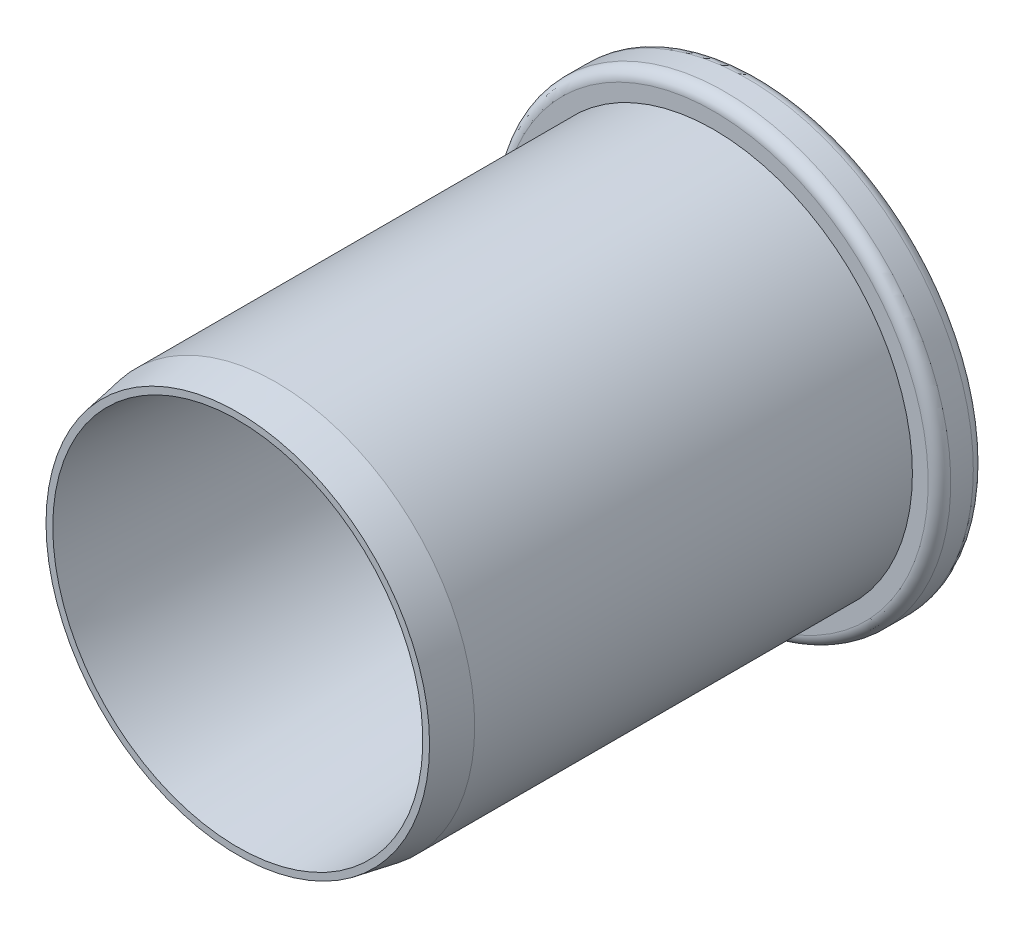
ISO-10303-21;
HEADER;
FILE_DESCRIPTION(('STEP AP214'),'2;1');
FILE_NAME('part.step','',(''),(''),'','','');
FILE_SCHEMA(('AUTOMOTIVE_DESIGN { 1 0 10303 214 1 1 1 1 }'));
ENDSEC;
DATA;
#1=APPLICATION_CONTEXT('core data for automotive mechanical design processes');
#2=APPLICATION_PROTOCOL_DEFINITION('international standard','automotive_design',2000,#1);
#3=PRODUCT_CONTEXT('',#1,'mechanical');
#4=PRODUCT('Part','Part','',(#3));
#5=PRODUCT_RELATED_PRODUCT_CATEGORY('part','',(#4));
#6=PRODUCT_DEFINITION_FORMATION('','',#4);
#7=PRODUCT_DEFINITION_CONTEXT('part definition',#1,'design');
#8=PRODUCT_DEFINITION('design','',#6,#7);
#9=PRODUCT_DEFINITION_SHAPE('','',#8);
#10=(LENGTH_UNIT() NAMED_UNIT(*) SI_UNIT(.MILLI.,.METRE.));
#11=(NAMED_UNIT(*) PLANE_ANGLE_UNIT() SI_UNIT($,.RADIAN.));
#12=(NAMED_UNIT(*) SI_UNIT($,.STERADIAN.) SOLID_ANGLE_UNIT());
#13=UNCERTAINTY_MEASURE_WITH_UNIT(LENGTH_MEASURE(1.E-05),#10,'distance_accuracy_value','');
#14=(GEOMETRIC_REPRESENTATION_CONTEXT(3) GLOBAL_UNCERTAINTY_ASSIGNED_CONTEXT((#13)) GLOBAL_UNIT_ASSIGNED_CONTEXT((#10,
#11,#12)) REPRESENTATION_CONTEXT('',''));
#15=CARTESIAN_POINT('',(0.,0.,0.));
#16=DIRECTION('',(0.,0.,1.));
#17=DIRECTION('',(1.,0.,0.));
#18=AXIS2_PLACEMENT_3D('',#15,#16,#17);
#19=CARTESIAN_POINT('',(0.,0.,0.));
#20=DIRECTION('',(0.,0.,-1.));
#21=DIRECTION('',(-1.,0.,0.));
#22=AXIS2_PLACEMENT_3D('',#19,#20,#21);
#23=CYLINDRICAL_SURFACE('',#22,10.);
#24=CARTESIAN_POINT('',(0.,0.,1.5));
#25=DIRECTION('',(0.,0.,-1.));
#26=DIRECTION('',(-1.,0.,0.));
#27=AXIS2_PLACEMENT_3D('',#24,#25,#26);
#28=CIRCLE('',#27,10.);
#29=CARTESIAN_POINT('',(-10.,0.,1.5));
#30=VERTEX_POINT('',#29);
#31=EDGE_CURVE('E40',#30,#30,#28,.T.);
#32=ORIENTED_EDGE('',*,*,#31,.T.);
#33=EDGE_LOOP('',(#32));
#34=FACE_BOUND('',#33,.T.);
#35=CARTESIAN_POINT('',(0.,0.,0.5));
#36=DIRECTION('',(0.,0.,1.));
#37=DIRECTION('',(1.,0.,0.));
#38=AXIS2_PLACEMENT_3D('',#35,#36,#37);
#39=CIRCLE('',#38,10.);
#40=CARTESIAN_POINT('',(10.,0.,0.5));
#41=VERTEX_POINT('',#40);
#42=EDGE_CURVE('E44',#41,#41,#39,.T.);
#43=ORIENTED_EDGE('',*,*,#42,.T.);
#44=EDGE_LOOP('',(#43));
#45=FACE_BOUND('',#44,.T.);
#46=ADVANCED_FACE('F33',(#34,#45),#23,.T.);
#47=CARTESIAN_POINT('',(10.,0.,2.));
#48=DIRECTION('',(0.,0.,-1.));
#49=DIRECTION('',(-1.,0.,0.));
#50=AXIS2_PLACEMENT_3D('',#47,#48,#49);
#51=PLANE('',#50);
#52=CARTESIAN_POINT('',(0.,0.,2.));
#53=DIRECTION('',(0.,0.,-1.));
#54=DIRECTION('',(-1.,0.,0.));
#55=AXIS2_PLACEMENT_3D('',#52,#53,#54);
#56=CIRCLE('',#55,9.5);
#57=CARTESIAN_POINT('',(-9.5,0.,2.));
#58=VERTEX_POINT('',#57);
#59=EDGE_CURVE('E10',#58,#58,#56,.F.);
#60=ORIENTED_EDGE('',*,*,#59,.T.);
#61=EDGE_LOOP('',(#60));
#62=FACE_BOUND('',#61,.T.);
#63=CARTESIAN_POINT('',(0.,0.,2.));
#64=DIRECTION('',(0.,0.,-1.));
#65=DIRECTION('',(-1.,0.,0.));
#66=AXIS2_PLACEMENT_3D('',#63,#64,#65);
#67=CIRCLE('',#66,8.8);
#68=CARTESIAN_POINT('',(-8.8,0.,2.));
#69=VERTEX_POINT('',#68);
#70=EDGE_CURVE('E59',#69,#69,#67,.T.);
#71=ORIENTED_EDGE('',*,*,#70,.T.);
#72=EDGE_LOOP('',(#71));
#73=FACE_BOUND('',#72,.T.);
#74=ADVANCED_FACE('F96',(#62,#73),#51,.F.);
#75=CARTESIAN_POINT('',(0.,0.,0.));
#76=DIRECTION('',(0.,0.,-1.));
#77=DIRECTION('',(-1.,0.,0.));
#78=AXIS2_PLACEMENT_3D('',#75,#76,#77);
#79=CYLINDRICAL_SURFACE('',#78,8.8);
#80=ORIENTED_EDGE('',*,*,#70,.F.);
#81=EDGE_LOOP('',(#80));
#82=FACE_BOUND('',#81,.T.);
#83=CARTESIAN_POINT('',(0.,0.,21.3986154541147));
#84=DIRECTION('',(0.,0.,-1.));
#85=DIRECTION('',(-1.,0.,0.));
#86=AXIS2_PLACEMENT_3D('',#83,#84,#85);
#87=CIRCLE('',#86,8.8);
#88=CARTESIAN_POINT('',(-8.8,0.,21.3986154541147));
#89=VERTEX_POINT('',#88);
#90=EDGE_CURVE('E62',#89,#89,#87,.T.);
#91=ORIENTED_EDGE('',*,*,#90,.T.);
#92=EDGE_LOOP('',(#91));
#93=FACE_BOUND('',#92,.T.);
#94=ADVANCED_FACE('F101',(#82,#93),#79,.T.);
#95=CARTESIAN_POINT('',(0.,0.,23.1));
#96=DIRECTION('',(0.,0.,-1.));
#97=DIRECTION('',(-1.,0.,0.));
#98=AXIS2_PLACEMENT_3D('',#95,#96,#97);
#99=CONICAL_SURFACE('',#98,8.5,0.174532925199437);
#100=ORIENTED_EDGE('',*,*,#90,.F.);
#101=EDGE_LOOP('',(#100));
#102=FACE_BOUND('',#101,.T.);
#103=CARTESIAN_POINT('',(0.,0.,23.1));
#104=DIRECTION('',(0.,0.,-1.));
#105=DIRECTION('',(-1.,0.,0.));
#106=AXIS2_PLACEMENT_3D('',#103,#104,#105);
#107=CIRCLE('',#106,8.5);
#108=CARTESIAN_POINT('',(-8.5,0.,23.1));
#109=VERTEX_POINT('',#108);
#110=EDGE_CURVE('E65',#109,#109,#107,.T.);
#111=ORIENTED_EDGE('',*,*,#110,.T.);
#112=EDGE_LOOP('',(#111));
#113=FACE_BOUND('',#112,.T.);
#114=ADVANCED_FACE('F179',(#102,#113),#99,.T.);
#115=CARTESIAN_POINT('',(8.5,0.,23.1));
#116=DIRECTION('',(0.,0.,-1.));
#117=DIRECTION('',(-1.,0.,0.));
#118=AXIS2_PLACEMENT_3D('',#115,#116,#117);
#119=PLANE('',#118);
#120=ORIENTED_EDGE('',*,*,#110,.F.);
#121=EDGE_LOOP('',(#120));
#122=FACE_BOUND('',#121,.T.);
#123=CARTESIAN_POINT('',(0.,0.,23.1));
#124=DIRECTION('',(0.,0.,-1.));
#125=DIRECTION('',(-1.,0.,0.));
#126=AXIS2_PLACEMENT_3D('',#123,#124,#125);
#127=CIRCLE('',#126,8.2);
#128=CARTESIAN_POINT('',(-8.2,0.,23.1));
#129=VERTEX_POINT('',#128);
#130=EDGE_CURVE('E68',#129,#129,#127,.T.);
#131=ORIENTED_EDGE('',*,*,#130,.T.);
#132=EDGE_LOOP('',(#131));
#133=FACE_BOUND('',#132,.T.);
#134=ADVANCED_FACE('F169',(#122,#133),#119,.F.);
#135=CARTESIAN_POINT('',(0.,0.,10.));
#136=DIRECTION('',(0.,0.,1.));
#137=DIRECTION('',(1.,0.,0.));
#138=AXIS2_PLACEMENT_3D('',#135,#136,#137);
#139=CONICAL_SURFACE('',#138,7.3,0.0685945034542746);
#140=ORIENTED_EDGE('',*,*,#130,.F.);
#141=EDGE_LOOP('',(#140));
#142=FACE_BOUND('',#141,.T.);
#143=CARTESIAN_POINT('',(0.,0.,10.));
#144=DIRECTION('',(0.,0.,-1.));
#145=DIRECTION('',(-1.,0.,0.));
#146=AXIS2_PLACEMENT_3D('',#143,#144,#145);
#147=CIRCLE('',#146,7.3);
#148=CARTESIAN_POINT('',(-7.3,0.,10.));
#149=VERTEX_POINT('',#148);
#150=EDGE_CURVE('E71',#149,#149,#147,.T.);
#151=ORIENTED_EDGE('',*,*,#150,.T.);
#152=EDGE_LOOP('',(#151));
#153=FACE_BOUND('',#152,.T.);
#154=ADVANCED_FACE('F92',(#142,#153),#139,.F.);
#155=CARTESIAN_POINT('',(3.23673019291531,0.,10.));
#156=DIRECTION('',(0.,0.,-1.));
#157=DIRECTION('',(-1.,0.,0.));
#158=AXIS2_PLACEMENT_3D('',#155,#156,#157);
#159=PLANE('',#158);
#160=ORIENTED_EDGE('',*,*,#150,.F.);
#161=EDGE_LOOP('',(#160));
#162=FACE_BOUND('',#161,.T.);
#163=CARTESIAN_POINT('',(0.,0.,10.));
#164=DIRECTION('',(0.,0.,-1.));
#165=DIRECTION('',(-1.,0.,0.));
#166=AXIS2_PLACEMENT_3D('',#163,#164,#165);
#167=CIRCLE('',#166,3.23673019291531);
#168=CARTESIAN_POINT('',(-3.23673019291531,0.,10.));
#169=VERTEX_POINT('',#168);
#170=EDGE_CURVE('E74',#169,#169,#167,.T.);
#171=ORIENTED_EDGE('',*,*,#170,.T.);
#172=EDGE_LOOP('',(#171));
#173=FACE_BOUND('',#172,.T.);
#174=ADVANCED_FACE('F78',(#162,#173),#159,.F.);
#175=CARTESIAN_POINT('',(0.,0.,0.));
#176=DIRECTION('',(0.,0.,-1.));
#177=DIRECTION('',(-1.,0.,0.));
#178=AXIS2_PLACEMENT_3D('',#175,#176,#177);
#179=CONICAL_SURFACE('',#178,5.,0.174532925199437);
#180=CARTESIAN_POINT('',(0.,0.,0.413175911166529));
#181=DIRECTION('',(0.,0.,1.));
#182=DIRECTION('',(1.,0.,0.));
#183=AXIS2_PLACEMENT_3D('',#180,#181,#182);
#184=CIRCLE('',#183,4.92714593908254);
#185=CARTESIAN_POINT('',(4.92714593908254,0.,0.413175911166529));
#186=VERTEX_POINT('',#185);
#187=EDGE_CURVE('E56',#186,#186,#184,.F.);
#188=ORIENTED_EDGE('',*,*,#187,.T.);
#189=EDGE_LOOP('',(#188));
#190=FACE_BOUND('',#189,.T.);
#191=ORIENTED_EDGE('',*,*,#170,.F.);
#192=EDGE_LOOP('',(#191));
#193=FACE_BOUND('',#192,.T.);
#194=ADVANCED_FACE('F80',(#190,#193),#179,.F.);
#195=CARTESIAN_POINT('',(5.,0.,0.));
#196=DIRECTION('',(0.,0.,1.));
#197=DIRECTION('',(1.,0.,0.));
#198=AXIS2_PLACEMENT_3D('',#195,#196,#197);
#199=PLANE('',#198);
#200=CARTESIAN_POINT('',(0.,0.,0.));
#201=DIRECTION('',(0.,0.,1.));
#202=DIRECTION('',(1.,0.,0.));
#203=AXIS2_PLACEMENT_3D('',#200,#201,#202);
#204=CIRCLE('',#203,5.41954981558864);
#205=CARTESIAN_POINT('',(5.41954981558864,0.,0.));
#206=VERTEX_POINT('',#205);
#207=EDGE_CURVE('E48',#206,#206,#204,.T.);
#208=ORIENTED_EDGE('',*,*,#207,.T.);
#209=EDGE_LOOP('',(#208));
#210=FACE_BOUND('',#209,.T.);
#211=CARTESIAN_POINT('',(0.,0.,0.));
#212=DIRECTION('',(0.,0.,1.));
#213=DIRECTION('',(1.,0.,0.));
#214=AXIS2_PLACEMENT_3D('',#211,#212,#213);
#215=CIRCLE('',#214,9.5);
#216=CARTESIAN_POINT('',(9.5,0.,0.));
#217=VERTEX_POINT('',#216);
#218=EDGE_CURVE('E53',#217,#217,#215,.F.);
#219=ORIENTED_EDGE('',*,*,#218,.T.);
#220=EDGE_LOOP('',(#219));
#221=FACE_BOUND('',#220,.T.);
#222=ADVANCED_FACE('F82',(#210,#221),#199,.F.);
#223=CARTESIAN_POINT('',(0.,0.,0.5));
#224=DIRECTION('',(0.,0.,1.));
#225=DIRECTION('',(1.,0.,0.));
#226=AXIS2_PLACEMENT_3D('',#223,#224,#225);
#227=TOROIDAL_SURFACE('',#226,5.41954981558864,0.5);
#228=ORIENTED_EDGE('',*,*,#207,.F.);
#229=EDGE_LOOP('',(#228));
#230=FACE_BOUND('',#229,.T.);
#231=ORIENTED_EDGE('',*,*,#187,.F.);
#232=EDGE_LOOP('',(#231));
#233=FACE_BOUND('',#232,.T.);
#234=ADVANCED_FACE('F89',(#230,#233),#227,.T.);
#235=CARTESIAN_POINT('',(0.,0.,1.5));
#236=DIRECTION('',(0.,0.,-1.));
#237=DIRECTION('',(-1.,0.,0.));
#238=AXIS2_PLACEMENT_3D('',#235,#236,#237);
#239=TOROIDAL_SURFACE('',#238,9.5,0.5);
#240=ORIENTED_EDGE('',*,*,#59,.F.);
#241=EDGE_LOOP('',(#240));
#242=FACE_BOUND('',#241,.T.);
#243=ORIENTED_EDGE('',*,*,#31,.F.);
#244=EDGE_LOOP('',(#243));
#245=FACE_BOUND('',#244,.T.);
#246=ADVANCED_FACE('F107',(#242,#245),#239,.T.);
#247=CARTESIAN_POINT('',(0.,0.,0.5));
#248=DIRECTION('',(0.,0.,1.));
#249=DIRECTION('',(1.,0.,0.));
#250=AXIS2_PLACEMENT_3D('',#247,#248,#249);
#251=TOROIDAL_SURFACE('',#250,9.5,0.5);
#252=ORIENTED_EDGE('',*,*,#42,.F.);
#253=EDGE_LOOP('',(#252));
#254=FACE_BOUND('',#253,.T.);
#255=ORIENTED_EDGE('',*,*,#218,.F.);
#256=EDGE_LOOP('',(#255));
#257=FACE_BOUND('',#256,.T.);
#258=ADVANCED_FACE('F35',(#254,#257),#251,.T.);
#259=CLOSED_SHELL('',(#46,#74,#94,#114,#134,#154,#174,#194,#222,#234,#246,#258));
#260=MANIFOLD_SOLID_BREP('B2',#259);
#261=ADVANCED_BREP_SHAPE_REPRESENTATION('',(#18,#260),#14);
#262=SHAPE_DEFINITION_REPRESENTATION(#9,#261);
ENDSEC;
END-ISO-10303-21;
